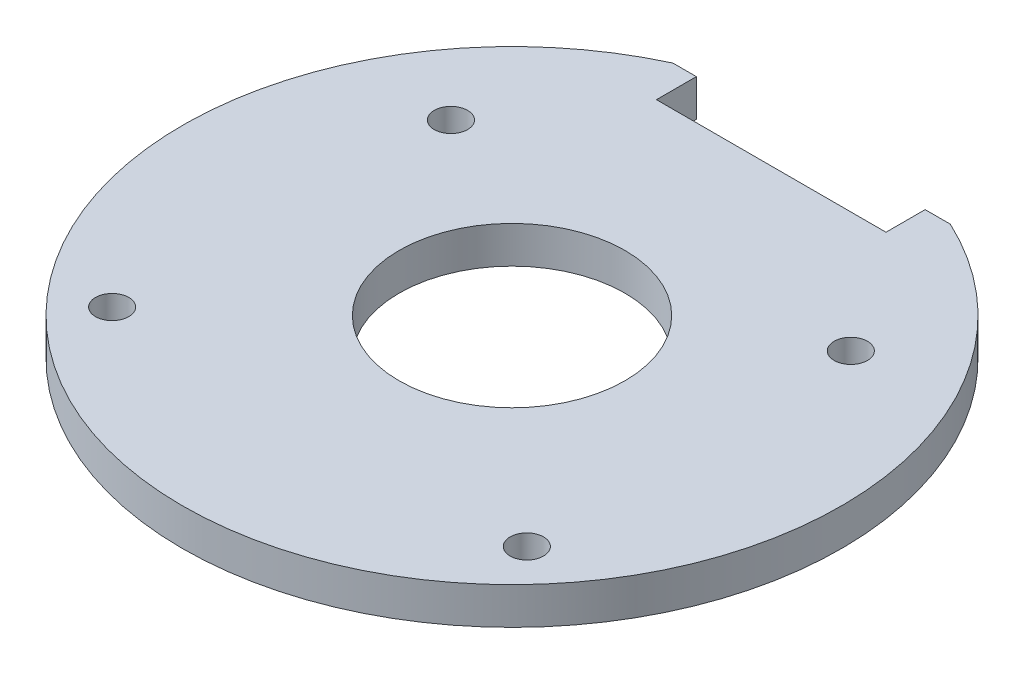
ISO-10303-21;
HEADER;
FILE_DESCRIPTION(('STEP AP214'),'2;1');
FILE_NAME('part.step','',(''),(''),'','','');
FILE_SCHEMA(('AUTOMOTIVE_DESIGN { 1 0 10303 214 1 1 1 1 }'));
ENDSEC;
DATA;
#1=APPLICATION_CONTEXT('core data for automotive mechanical design processes');
#2=APPLICATION_PROTOCOL_DEFINITION('international standard','automotive_design',2000,#1);
#3=PRODUCT_CONTEXT('',#1,'mechanical');
#4=PRODUCT('Part','Part','',(#3));
#5=PRODUCT_RELATED_PRODUCT_CATEGORY('part','',(#4));
#6=PRODUCT_DEFINITION_FORMATION('','',#4);
#7=PRODUCT_DEFINITION_CONTEXT('part definition',#1,'design');
#8=PRODUCT_DEFINITION('design','',#6,#7);
#9=PRODUCT_DEFINITION_SHAPE('','',#8);
#10=(LENGTH_UNIT() NAMED_UNIT(*) SI_UNIT(.MILLI.,.METRE.));
#11=(NAMED_UNIT(*) PLANE_ANGLE_UNIT() SI_UNIT($,.RADIAN.));
#12=(NAMED_UNIT(*) SI_UNIT($,.STERADIAN.) SOLID_ANGLE_UNIT());
#13=UNCERTAINTY_MEASURE_WITH_UNIT(LENGTH_MEASURE(1.E-05),#10,'distance_accuracy_value','');
#14=(GEOMETRIC_REPRESENTATION_CONTEXT(3) GLOBAL_UNCERTAINTY_ASSIGNED_CONTEXT((#13)) GLOBAL_UNIT_ASSIGNED_CONTEXT((#10,
#11,#12)) REPRESENTATION_CONTEXT('',''));
#15=CARTESIAN_POINT('',(0.,0.,0.));
#16=DIRECTION('',(0.,0.,1.));
#17=DIRECTION('',(1.,0.,0.));
#18=AXIS2_PLACEMENT_3D('',#15,#16,#17);
#19=CARTESIAN_POINT('',(0.,5.,0.));
#20=DIRECTION('',(0.,1.,0.));
#21=DIRECTION('',(0.,0.,1.));
#22=AXIS2_PLACEMENT_3D('',#19,#20,#21);
#23=PLANE('',#22);
#24=CARTESIAN_POINT('',(28.,5.,26.));
#25=DIRECTION('',(0.,1.,0.));
#26=DIRECTION('',(0.,0.,1.));
#27=AXIS2_PLACEMENT_3D('',#24,#25,#26);
#28=CIRCLE('',#27,2.25);
#29=CARTESIAN_POINT('',(28.,5.,28.25));
#30=VERTEX_POINT('',#29);
#31=EDGE_CURVE('E220',#30,#30,#28,.T.);
#32=ORIENTED_EDGE('',*,*,#31,.F.);
#33=EDGE_LOOP('',(#32));
#34=FACE_BOUND('',#33,.T.);
#35=CARTESIAN_POINT('',(-27.,5.,-18.75));
#36=DIRECTION('',(0.,1.,0.));
#37=DIRECTION('',(0.,0.,1.));
#38=AXIS2_PLACEMENT_3D('',#35,#36,#37);
#39=CIRCLE('',#38,2.25);
#40=CARTESIAN_POINT('',(-27.,5.,-16.5));
#41=VERTEX_POINT('',#40);
#42=EDGE_CURVE('E236',#41,#41,#39,.T.);
#43=ORIENTED_EDGE('',*,*,#42,.F.);
#44=EDGE_LOOP('',(#43));
#45=FACE_BOUND('',#44,.T.);
#46=DIRECTION('',(-1.,0.,0.));
#47=VECTOR('',#46,1.);
#48=CARTESIAN_POINT('',(-15.5,5.,-40.3934852543837));
#49=LINE('',#48,#47);
#50=CARTESIAN_POINT('',(-15.5,5.,-40.3934852543837));
#51=VERTEX_POINT('',#50);
#52=CARTESIAN_POINT('',(-18.6712706853039,5.,-40.3934852543837));
#53=VERTEX_POINT('',#52);
#54=EDGE_CURVE('E148',#51,#53,#49,.T.);
#55=ORIENTED_EDGE('',*,*,#54,.T.);
#56=CARTESIAN_POINT('',(0.,5.,0.));
#57=DIRECTION('',(0.,1.,0.));
#58=DIRECTION('',(0.,0.,1.));
#59=AXIS2_PLACEMENT_3D('',#56,#57,#58);
#60=CIRCLE('',#59,44.5);
#61=CARTESIAN_POINT('',(18.9013513557454,5.,-40.2863366034523));
#62=VERTEX_POINT('',#61);
#63=EDGE_CURVE('E95',#53,#62,#60,.T.);
#64=ORIENTED_EDGE('',*,*,#63,.T.);
#65=DIRECTION('',(-1.,0.,0.));
#66=VECTOR('',#65,1.);
#67=CARTESIAN_POINT('',(15.5,5.,-40.2863366034523));
#68=LINE('',#67,#66);
#69=CARTESIAN_POINT('',(15.5,5.,-40.2863366034523));
#70=VERTEX_POINT('',#69);
#71=EDGE_CURVE('E108',#62,#70,#68,.T.);
#72=ORIENTED_EDGE('',*,*,#71,.T.);
#73=DIRECTION('',(0.,0.,1.));
#74=VECTOR('',#73,1.);
#75=CARTESIAN_POINT('',(15.5,5.,-40.2863366034523));
#76=LINE('',#75,#74);
#77=CARTESIAN_POINT('',(15.5,5.,-35.));
#78=VERTEX_POINT('',#77);
#79=EDGE_CURVE('E102',#70,#78,#76,.T.);
#80=ORIENTED_EDGE('',*,*,#79,.T.);
#81=DIRECTION('',(-1.,0.,0.));
#82=VECTOR('',#81,1.);
#83=CARTESIAN_POINT('',(-15.5,5.,-35.));
#84=LINE('',#83,#82);
#85=CARTESIAN_POINT('',(-15.5,5.,-35.));
#86=VERTEX_POINT('',#85);
#87=EDGE_CURVE('E106',#78,#86,#84,.T.);
#88=ORIENTED_EDGE('',*,*,#87,.T.);
#89=DIRECTION('',(0.,0.,-1.));
#90=VECTOR('',#89,1.);
#91=CARTESIAN_POINT('',(-15.5,5.,-40.3934852543837));
#92=LINE('',#91,#90);
#93=EDGE_CURVE('E58',#86,#51,#92,.T.);
#94=ORIENTED_EDGE('',*,*,#93,.T.);
#95=EDGE_LOOP('',(#55,#64,#72,#80,#88,#94));
#96=FACE_BOUND('',#95,.T.);
#97=CARTESIAN_POINT('',(0.,5.,0.));
#98=DIRECTION('',(0.,1.,0.));
#99=DIRECTION('',(0.,0.,1.));
#100=AXIS2_PLACEMENT_3D('',#97,#98,#99);
#101=CIRCLE('',#100,15.25);
#102=CARTESIAN_POINT('',(0.,5.,15.25));
#103=VERTEX_POINT('',#102);
#104=EDGE_CURVE('E136',#103,#103,#101,.T.);
#105=ORIENTED_EDGE('',*,*,#104,.F.);
#106=EDGE_LOOP('',(#105));
#107=FACE_BOUND('',#106,.T.);
#108=CARTESIAN_POINT('',(27.,5.,-18.75));
#109=DIRECTION('',(0.,1.,0.));
#110=DIRECTION('',(0.,0.,1.));
#111=AXIS2_PLACEMENT_3D('',#108,#109,#110);
#112=CIRCLE('',#111,2.25);
#113=CARTESIAN_POINT('',(27.,5.,-16.5));
#114=VERTEX_POINT('',#113);
#115=EDGE_CURVE('E228',#114,#114,#112,.T.);
#116=ORIENTED_EDGE('',*,*,#115,.F.);
#117=EDGE_LOOP('',(#116));
#118=FACE_BOUND('',#117,.T.);
#119=CARTESIAN_POINT('',(-28.,5.,26.));
#120=DIRECTION('',(0.,1.,0.));
#121=DIRECTION('',(0.,0.,1.));
#122=AXIS2_PLACEMENT_3D('',#119,#120,#121);
#123=CIRCLE('',#122,2.25);
#124=CARTESIAN_POINT('',(-28.,5.,28.25));
#125=VERTEX_POINT('',#124);
#126=EDGE_CURVE('E208',#125,#125,#123,.T.);
#127=ORIENTED_EDGE('',*,*,#126,.F.);
#128=EDGE_LOOP('',(#127));
#129=FACE_BOUND('',#128,.T.);
#130=ADVANCED_FACE('F40',(#34,#45,#96,#107,#118,#129),#23,.T.);
#131=CARTESIAN_POINT('',(0.,0.,0.));
#132=DIRECTION('',(0.,1.,0.));
#133=DIRECTION('',(0.,0.,1.));
#134=AXIS2_PLACEMENT_3D('',#131,#132,#133);
#135=PLANE('',#134);
#136=DIRECTION('',(-1.,0.,0.));
#137=VECTOR('',#136,1.);
#138=CARTESIAN_POINT('',(-15.5,0.,-40.3934852543837));
#139=LINE('',#138,#137);
#140=CARTESIAN_POINT('',(-15.5,0.,-40.3934852543837));
#141=VERTEX_POINT('',#140);
#142=CARTESIAN_POINT('',(-18.6712706853039,0.,-40.3934852543837));
#143=VERTEX_POINT('',#142);
#144=EDGE_CURVE('E131',#141,#143,#139,.T.);
#145=ORIENTED_EDGE('',*,*,#144,.F.);
#146=DIRECTION('',(0.,0.,-1.));
#147=VECTOR('',#146,1.);
#148=CARTESIAN_POINT('',(-15.5,0.,-40.3934852543837));
#149=LINE('',#148,#147);
#150=CARTESIAN_POINT('',(-15.5,0.,-35.));
#151=VERTEX_POINT('',#150);
#152=EDGE_CURVE('E87',#151,#141,#149,.T.);
#153=ORIENTED_EDGE('',*,*,#152,.F.);
#154=DIRECTION('',(-1.,0.,0.));
#155=VECTOR('',#154,1.);
#156=CARTESIAN_POINT('',(-15.5,0.,-35.));
#157=LINE('',#156,#155);
#158=CARTESIAN_POINT('',(15.5,0.,-35.));
#159=VERTEX_POINT('',#158);
#160=EDGE_CURVE('E81',#159,#151,#157,.T.);
#161=ORIENTED_EDGE('',*,*,#160,.F.);
#162=DIRECTION('',(0.,0.,1.));
#163=VECTOR('',#162,1.);
#164=CARTESIAN_POINT('',(15.5,0.,-40.2863366034523));
#165=LINE('',#164,#163);
#166=CARTESIAN_POINT('',(15.5,0.,-40.2863366034523));
#167=VERTEX_POINT('',#166);
#168=EDGE_CURVE('E117',#167,#159,#165,.T.);
#169=ORIENTED_EDGE('',*,*,#168,.F.);
#170=DIRECTION('',(-1.,0.,0.));
#171=VECTOR('',#170,1.);
#172=CARTESIAN_POINT('',(15.5,0.,-40.2863366034523));
#173=LINE('',#172,#171);
#174=CARTESIAN_POINT('',(18.9013513557454,0.,-40.2863366034523));
#175=VERTEX_POINT('',#174);
#176=EDGE_CURVE('E139',#175,#167,#173,.T.);
#177=ORIENTED_EDGE('',*,*,#176,.F.);
#178=CARTESIAN_POINT('',(0.,0.,0.));
#179=DIRECTION('',(0.,1.,0.));
#180=DIRECTION('',(0.,0.,1.));
#181=AXIS2_PLACEMENT_3D('',#178,#179,#180);
#182=CIRCLE('',#181,44.5);
#183=EDGE_CURVE('E135',#143,#175,#182,.T.);
#184=ORIENTED_EDGE('',*,*,#183,.F.);
#185=EDGE_LOOP('',(#145,#153,#161,#169,#177,#184));
#186=FACE_BOUND('',#185,.T.);
#187=CARTESIAN_POINT('',(0.,0.,0.));
#188=DIRECTION('',(0.,1.,0.));
#189=DIRECTION('',(0.,0.,1.));
#190=AXIS2_PLACEMENT_3D('',#187,#188,#189);
#191=CIRCLE('',#190,15.25);
#192=CARTESIAN_POINT('',(0.,0.,15.25));
#193=VERTEX_POINT('',#192);
#194=EDGE_CURVE('E240',#193,#193,#191,.T.);
#195=ORIENTED_EDGE('',*,*,#194,.T.);
#196=EDGE_LOOP('',(#195));
#197=FACE_BOUND('',#196,.T.);
#198=CARTESIAN_POINT('',(-27.,0.,-18.75));
#199=DIRECTION('',(0.,1.,0.));
#200=DIRECTION('',(0.,0.,1.));
#201=AXIS2_PLACEMENT_3D('',#198,#199,#200);
#202=CIRCLE('',#201,2.25);
#203=CARTESIAN_POINT('',(-27.,0.,-16.5));
#204=VERTEX_POINT('',#203);
#205=EDGE_CURVE('E232',#204,#204,#202,.T.);
#206=ORIENTED_EDGE('',*,*,#205,.T.);
#207=EDGE_LOOP('',(#206));
#208=FACE_BOUND('',#207,.T.);
#209=CARTESIAN_POINT('',(27.,0.,-18.75));
#210=DIRECTION('',(0.,1.,0.));
#211=DIRECTION('',(0.,0.,1.));
#212=AXIS2_PLACEMENT_3D('',#209,#210,#211);
#213=CIRCLE('',#212,2.25);
#214=CARTESIAN_POINT('',(27.,0.,-16.5));
#215=VERTEX_POINT('',#214);
#216=EDGE_CURVE('E224',#215,#215,#213,.T.);
#217=ORIENTED_EDGE('',*,*,#216,.T.);
#218=EDGE_LOOP('',(#217));
#219=FACE_BOUND('',#218,.T.);
#220=CARTESIAN_POINT('',(28.,0.,26.));
#221=DIRECTION('',(0.,1.,0.));
#222=DIRECTION('',(0.,0.,1.));
#223=AXIS2_PLACEMENT_3D('',#220,#221,#222);
#224=CIRCLE('',#223,2.25);
#225=CARTESIAN_POINT('',(28.,0.,28.25));
#226=VERTEX_POINT('',#225);
#227=EDGE_CURVE('E217',#226,#226,#224,.T.);
#228=ORIENTED_EDGE('',*,*,#227,.T.);
#229=EDGE_LOOP('',(#228));
#230=FACE_BOUND('',#229,.T.);
#231=CARTESIAN_POINT('',(-28.,0.,26.));
#232=DIRECTION('',(0.,1.,0.));
#233=DIRECTION('',(0.,0.,1.));
#234=AXIS2_PLACEMENT_3D('',#231,#232,#233);
#235=CIRCLE('',#234,2.25);
#236=CARTESIAN_POINT('',(-28.,0.,28.25));
#237=VERTEX_POINT('',#236);
#238=EDGE_CURVE('E211',#237,#237,#235,.T.);
#239=ORIENTED_EDGE('',*,*,#238,.T.);
#240=EDGE_LOOP('',(#239));
#241=FACE_BOUND('',#240,.T.);
#242=ADVANCED_FACE('F162',(#186,#197,#208,#219,#230,#241),#135,.F.);
#243=CARTESIAN_POINT('',(-15.5,5.,-40.3934852543837));
#244=DIRECTION('',(0.,0.,1.));
#245=DIRECTION('',(1.,0.,0.));
#246=AXIS2_PLACEMENT_3D('',#243,#244,#245);
#247=PLANE('',#246);
#248=ORIENTED_EDGE('',*,*,#144,.T.);
#249=DIRECTION('',(0.,-1.,0.));
#250=VECTOR('',#249,1.);
#251=CARTESIAN_POINT('',(-18.6712706853039,5.,-40.3934852543837));
#252=LINE('',#251,#250);
#253=EDGE_CURVE('E11',#53,#143,#252,.T.);
#254=ORIENTED_EDGE('',*,*,#253,.F.);
#255=ORIENTED_EDGE('',*,*,#54,.F.);
#256=DIRECTION('',(0.,-1.,0.));
#257=VECTOR('',#256,1.);
#258=CARTESIAN_POINT('',(-15.5,5.,-40.3934852543837));
#259=LINE('',#258,#257);
#260=EDGE_CURVE('E127',#51,#141,#259,.T.);
#261=ORIENTED_EDGE('',*,*,#260,.T.);
#262=EDGE_LOOP('',(#248,#254,#255,#261));
#263=FACE_BOUND('',#262,.T.);
#264=ADVANCED_FACE('F42',(#263),#247,.F.);
#265=CARTESIAN_POINT('',(0.,5.,0.));
#266=DIRECTION('',(0.,-1.,0.));
#267=DIRECTION('',(0.,0.,-1.));
#268=AXIS2_PLACEMENT_3D('',#265,#266,#267);
#269=CYLINDRICAL_SURFACE('',#268,44.5);
#270=ORIENTED_EDGE('',*,*,#183,.T.);
#271=DIRECTION('',(0.,-1.,0.));
#272=VECTOR('',#271,1.);
#273=CARTESIAN_POINT('',(18.9013513557454,5.,-40.2863366034523));
#274=LINE('',#273,#272);
#275=EDGE_CURVE('E50',#62,#175,#274,.T.);
#276=ORIENTED_EDGE('',*,*,#275,.F.);
#277=ORIENTED_EDGE('',*,*,#63,.F.);
#278=ORIENTED_EDGE('',*,*,#253,.T.);
#279=EDGE_LOOP('',(#270,#276,#277,#278));
#280=FACE_BOUND('',#279,.T.);
#281=ADVANCED_FACE('F336',(#280),#269,.T.);
#282=CARTESIAN_POINT('',(15.5,5.,-40.2863366034523));
#283=DIRECTION('',(0.,0.,1.));
#284=DIRECTION('',(1.,0.,0.));
#285=AXIS2_PLACEMENT_3D('',#282,#283,#284);
#286=PLANE('',#285);
#287=ORIENTED_EDGE('',*,*,#176,.T.);
#288=DIRECTION('',(0.,-1.,0.));
#289=VECTOR('',#288,1.);
#290=CARTESIAN_POINT('',(15.5,5.,-40.2863366034523));
#291=LINE('',#290,#289);
#292=EDGE_CURVE('E119',#70,#167,#291,.T.);
#293=ORIENTED_EDGE('',*,*,#292,.F.);
#294=ORIENTED_EDGE('',*,*,#71,.F.);
#295=ORIENTED_EDGE('',*,*,#275,.T.);
#296=EDGE_LOOP('',(#287,#293,#294,#295));
#297=FACE_BOUND('',#296,.T.);
#298=ADVANCED_FACE('F159',(#297),#286,.F.);
#299=CARTESIAN_POINT('',(15.5,5.,-40.2863366034523));
#300=DIRECTION('',(1.,0.,0.));
#301=DIRECTION('',(0.,0.,-1.));
#302=AXIS2_PLACEMENT_3D('',#299,#300,#301);
#303=PLANE('',#302);
#304=ORIENTED_EDGE('',*,*,#168,.T.);
#305=DIRECTION('',(0.,-1.,0.));
#306=VECTOR('',#305,1.);
#307=CARTESIAN_POINT('',(15.5,5.,-35.));
#308=LINE('',#307,#306);
#309=EDGE_CURVE('E114',#78,#159,#308,.T.);
#310=ORIENTED_EDGE('',*,*,#309,.F.);
#311=ORIENTED_EDGE('',*,*,#79,.F.);
#312=ORIENTED_EDGE('',*,*,#292,.T.);
#313=EDGE_LOOP('',(#304,#310,#311,#312));
#314=FACE_BOUND('',#313,.T.);
#315=ADVANCED_FACE('F115',(#314),#303,.F.);
#316=CARTESIAN_POINT('',(-15.5,5.,-35.));
#317=DIRECTION('',(0.,0.,1.));
#318=DIRECTION('',(1.,0.,0.));
#319=AXIS2_PLACEMENT_3D('',#316,#317,#318);
#320=PLANE('',#319);
#321=ORIENTED_EDGE('',*,*,#160,.T.);
#322=DIRECTION('',(0.,-1.,0.));
#323=VECTOR('',#322,1.);
#324=CARTESIAN_POINT('',(-15.5,5.,-35.));
#325=LINE('',#324,#323);
#326=EDGE_CURVE('E120',#86,#151,#325,.T.);
#327=ORIENTED_EDGE('',*,*,#326,.F.);
#328=ORIENTED_EDGE('',*,*,#87,.F.);
#329=ORIENTED_EDGE('',*,*,#309,.T.);
#330=EDGE_LOOP('',(#321,#327,#328,#329));
#331=FACE_BOUND('',#330,.T.);
#332=ADVANCED_FACE('F122',(#331),#320,.F.);
#333=CARTESIAN_POINT('',(-15.5,5.,-40.3934852543837));
#334=DIRECTION('',(-1.,0.,0.));
#335=DIRECTION('',(0.,0.,1.));
#336=AXIS2_PLACEMENT_3D('',#333,#334,#335);
#337=PLANE('',#336);
#338=ORIENTED_EDGE('',*,*,#152,.T.);
#339=ORIENTED_EDGE('',*,*,#260,.F.);
#340=ORIENTED_EDGE('',*,*,#93,.F.);
#341=ORIENTED_EDGE('',*,*,#326,.T.);
#342=EDGE_LOOP('',(#338,#339,#340,#341));
#343=FACE_BOUND('',#342,.T.);
#344=ADVANCED_FACE('F167',(#343),#337,.F.);
#345=CARTESIAN_POINT('',(0.,5.,0.));
#346=DIRECTION('',(0.,-1.,0.));
#347=DIRECTION('',(0.,0.,-1.));
#348=AXIS2_PLACEMENT_3D('',#345,#346,#347);
#349=CYLINDRICAL_SURFACE('',#348,15.25);
#350=ORIENTED_EDGE('',*,*,#104,.T.);
#351=EDGE_LOOP('',(#350));
#352=FACE_BOUND('',#351,.T.);
#353=ORIENTED_EDGE('',*,*,#194,.F.);
#354=EDGE_LOOP('',(#353));
#355=FACE_BOUND('',#354,.T.);
#356=ADVANCED_FACE('F169',(#352,#355),#349,.F.);
#357=CARTESIAN_POINT('',(-27.,5.,-18.75));
#358=DIRECTION('',(0.,-1.,0.));
#359=DIRECTION('',(0.,0.,-1.));
#360=AXIS2_PLACEMENT_3D('',#357,#358,#359);
#361=CYLINDRICAL_SURFACE('',#360,2.25);
#362=ORIENTED_EDGE('',*,*,#42,.T.);
#363=EDGE_LOOP('',(#362));
#364=FACE_BOUND('',#363,.T.);
#365=ORIENTED_EDGE('',*,*,#205,.F.);
#366=EDGE_LOOP('',(#365));
#367=FACE_BOUND('',#366,.T.);
#368=ADVANCED_FACE('F175',(#364,#367),#361,.F.);
#369=CARTESIAN_POINT('',(27.,5.,-18.75));
#370=DIRECTION('',(0.,-1.,0.));
#371=DIRECTION('',(0.,0.,-1.));
#372=AXIS2_PLACEMENT_3D('',#369,#370,#371);
#373=CYLINDRICAL_SURFACE('',#372,2.25);
#374=ORIENTED_EDGE('',*,*,#115,.T.);
#375=EDGE_LOOP('',(#374));
#376=FACE_BOUND('',#375,.T.);
#377=ORIENTED_EDGE('',*,*,#216,.F.);
#378=EDGE_LOOP('',(#377));
#379=FACE_BOUND('',#378,.T.);
#380=ADVANCED_FACE('F191',(#376,#379),#373,.F.);
#381=CARTESIAN_POINT('',(28.,5.,26.));
#382=DIRECTION('',(0.,-1.,0.));
#383=DIRECTION('',(0.,0.,-1.));
#384=AXIS2_PLACEMENT_3D('',#381,#382,#383);
#385=CYLINDRICAL_SURFACE('',#384,2.25);
#386=ORIENTED_EDGE('',*,*,#31,.T.);
#387=EDGE_LOOP('',(#386));
#388=FACE_BOUND('',#387,.T.);
#389=ORIENTED_EDGE('',*,*,#227,.F.);
#390=EDGE_LOOP('',(#389));
#391=FACE_BOUND('',#390,.T.);
#392=ADVANCED_FACE('F195',(#388,#391),#385,.F.);
#393=CARTESIAN_POINT('',(-28.,5.,26.));
#394=DIRECTION('',(0.,-1.,0.));
#395=DIRECTION('',(0.,0.,-1.));
#396=AXIS2_PLACEMENT_3D('',#393,#394,#395);
#397=CYLINDRICAL_SURFACE('',#396,2.25);
#398=ORIENTED_EDGE('',*,*,#126,.T.);
#399=EDGE_LOOP('',(#398));
#400=FACE_BOUND('',#399,.T.);
#401=ORIENTED_EDGE('',*,*,#238,.F.);
#402=EDGE_LOOP('',(#401));
#403=FACE_BOUND('',#402,.T.);
#404=ADVANCED_FACE('F199',(#400,#403),#397,.F.);
#405=CLOSED_SHELL('',(#130,#242,#264,#281,#298,#315,#332,#344,#356,#368,#380,#392,#404));
#406=MANIFOLD_SOLID_BREP('B2',#405);
#407=ADVANCED_BREP_SHAPE_REPRESENTATION('',(#18,#406),#14);
#408=SHAPE_DEFINITION_REPRESENTATION(#9,#407);
ENDSEC;
END-ISO-10303-21;
